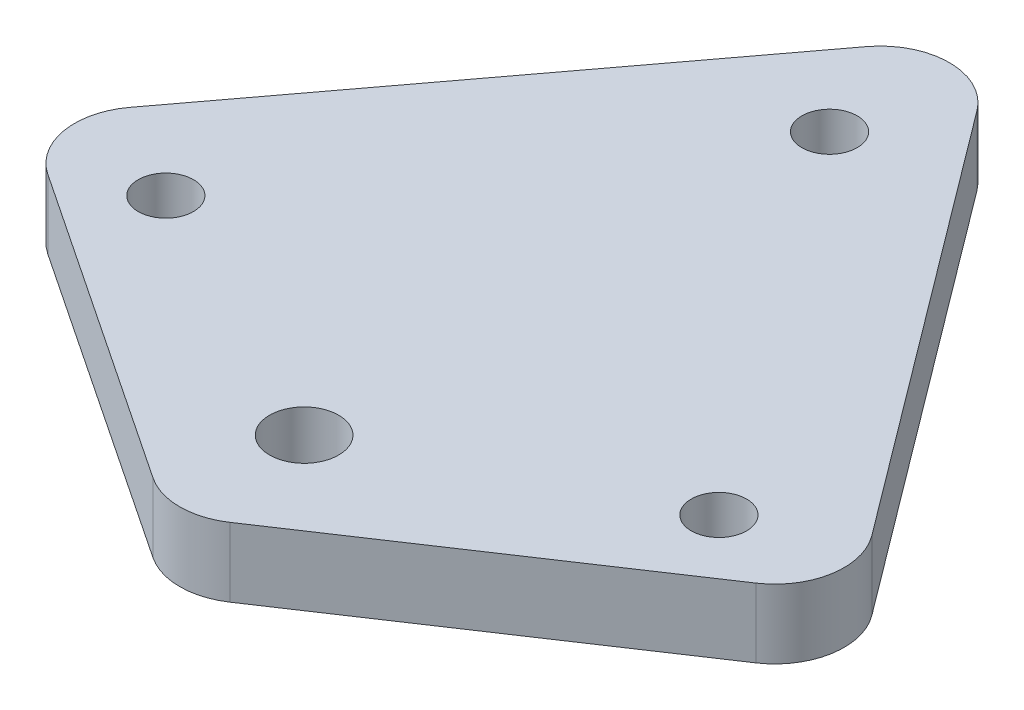
ISO-10303-21;
HEADER;
FILE_DESCRIPTION(('STEP AP214'),'2;1');
FILE_NAME('part.step','',(''),(''),'','','');
FILE_SCHEMA(('AUTOMOTIVE_DESIGN { 1 0 10303 214 1 1 1 1 }'));
ENDSEC;
DATA;
#1=APPLICATION_CONTEXT('core data for automotive mechanical design processes');
#2=APPLICATION_PROTOCOL_DEFINITION('international standard','automotive_design',2000,#1);
#3=PRODUCT_CONTEXT('',#1,'mechanical');
#4=PRODUCT('Part','Part','',(#3));
#5=PRODUCT_RELATED_PRODUCT_CATEGORY('part','',(#4));
#6=PRODUCT_DEFINITION_FORMATION('','',#4);
#7=PRODUCT_DEFINITION_CONTEXT('part definition',#1,'design');
#8=PRODUCT_DEFINITION('design','',#6,#7);
#9=PRODUCT_DEFINITION_SHAPE('','',#8);
#10=(LENGTH_UNIT() NAMED_UNIT(*) SI_UNIT(.MILLI.,.METRE.));
#11=(NAMED_UNIT(*) PLANE_ANGLE_UNIT() SI_UNIT($,.RADIAN.));
#12=(NAMED_UNIT(*) SI_UNIT($,.STERADIAN.) SOLID_ANGLE_UNIT());
#13=UNCERTAINTY_MEASURE_WITH_UNIT(LENGTH_MEASURE(1.E-05),#10,'distance_accuracy_value','');
#14=(GEOMETRIC_REPRESENTATION_CONTEXT(3) GLOBAL_UNCERTAINTY_ASSIGNED_CONTEXT((#13)) GLOBAL_UNIT_ASSIGNED_CONTEXT((#10,
#11,#12)) REPRESENTATION_CONTEXT('',''));
#15=CARTESIAN_POINT('',(0.,0.,0.));
#16=DIRECTION('',(0.,0.,1.));
#17=DIRECTION('',(1.,0.,0.));
#18=AXIS2_PLACEMENT_3D('',#15,#16,#17);
#19=CARTESIAN_POINT('',(0.,6.35,0.));
#20=DIRECTION('',(0.,1.,0.));
#21=DIRECTION('',(0.,0.,1.));
#22=AXIS2_PLACEMENT_3D('',#19,#20,#21);
#23=PLANE('',#22);
#24=CARTESIAN_POINT('',(25.4,6.35,-12.7));
#25=DIRECTION('',(0.,1.,0.));
#26=DIRECTION('',(0.,0.,-1.));
#27=AXIS2_PLACEMENT_3D('',#24,#25,#26);
#28=CIRCLE('',#27,2.54);
#29=CARTESIAN_POINT('',(25.4,6.35,-15.24));
#30=VERTEX_POINT('',#29);
#31=EDGE_CURVE('E201',#30,#30,#28,.T.);
#32=ORIENTED_EDGE('',*,*,#31,.F.);
#33=EDGE_LOOP('',(#32));
#34=FACE_BOUND('',#33,.T.);
#35=CARTESIAN_POINT('',(0.,6.35,0.));
#36=DIRECTION('',(0.,1.,0.));
#37=DIRECTION('',(0.,0.,1.));
#38=AXIS2_PLACEMENT_3D('',#35,#36,#37);
#39=CIRCLE('',#38,3.175);
#40=CARTESIAN_POINT('',(0.,6.35,3.175));
#41=VERTEX_POINT('',#40);
#42=EDGE_CURVE('E213',#41,#41,#39,.T.);
#43=ORIENTED_EDGE('',*,*,#42,.F.);
#44=EDGE_LOOP('',(#43));
#45=FACE_BOUND('',#44,.T.);
#46=DIRECTION('',(-0.6,0.,-0.8));
#47=VECTOR('',#46,1.);
#48=CARTESIAN_POINT('',(0.,6.35,-63.5));
#49=LINE('',#48,#47);
#50=CARTESIAN_POINT('',(34.0724582334673,6.35,-18.0700556887103));
#51=VERTEX_POINT('',#50);
#52=CARTESIAN_POINT('',(5.08,6.35,-56.7266666666667));
#53=VERTEX_POINT('',#52);
#54=EDGE_CURVE('E206',#51,#53,#49,.T.);
#55=ORIENTED_EDGE('',*,*,#54,.T.);
#56=CARTESIAN_POINT('',(0.,6.35,-52.9166666666667));
#57=DIRECTION('',(0.,1.,0.));
#58=DIRECTION('',(0.,0.,1.));
#59=AXIS2_PLACEMENT_3D('',#56,#57,#58);
#60=CIRCLE('',#59,6.35);
#61=CARTESIAN_POINT('',(-5.08,6.35,-56.7266666666667));
#62=VERTEX_POINT('',#61);
#63=EDGE_CURVE('E188',#53,#62,#60,.T.);
#64=ORIENTED_EDGE('',*,*,#63,.T.);
#65=DIRECTION('',(-0.6,0.,0.8));
#66=VECTOR('',#65,1.);
#67=CARTESIAN_POINT('',(0.,6.35,-63.5));
#68=LINE('',#67,#66);
#69=CARTESIAN_POINT('',(-34.0724582334673,6.35,-18.0700556887103));
#70=VERTEX_POINT('',#69);
#71=EDGE_CURVE('E143',#62,#70,#68,.T.);
#72=ORIENTED_EDGE('',*,*,#71,.T.);
#73=CARTESIAN_POINT('',(-28.9924582334673,6.35,-14.2600556887103));
#74=DIRECTION('',(0.,1.,0.));
#75=DIRECTION('',(0.,0.,1.));
#76=AXIS2_PLACEMENT_3D('',#73,#74,#75);
#77=CIRCLE('',#76,6.35);
#78=CARTESIAN_POINT('',(-32.5148044794975,6.35,-8.97653631966499));
#79=VERTEX_POINT('',#78);
#80=EDGE_CURVE('E68',#70,#79,#77,.T.);
#81=ORIENTED_EDGE('',*,*,#80,.T.);
#82=DIRECTION('',(0.832050294337844,0.,0.554700196225229));
#83=VECTOR('',#82,1.);
#84=CARTESIAN_POINT('',(-38.1,6.35,-12.7));
#85=LINE('',#84,#83);
#86=CARTESIAN_POINT('',(-3.5223462460302,6.35,10.3517691693132));
#87=VERTEX_POINT('',#86);
#88=EDGE_CURVE('E167',#79,#87,#85,.T.);
#89=ORIENTED_EDGE('',*,*,#88,.T.);
#90=CARTESIAN_POINT('',(0.,6.35,5.06824980026789));
#91=DIRECTION('',(0.,1.,0.));
#92=DIRECTION('',(0.,0.,1.));
#93=AXIS2_PLACEMENT_3D('',#90,#91,#92);
#94=CIRCLE('',#93,6.35);
#95=CARTESIAN_POINT('',(3.52234624603021,6.35,10.3517691693132));
#96=VERTEX_POINT('',#95);
#97=EDGE_CURVE('E180',#87,#96,#94,.T.);
#98=ORIENTED_EDGE('',*,*,#97,.T.);
#99=DIRECTION('',(0.832050294337844,0.,-0.554700196225229));
#100=VECTOR('',#99,1.);
#101=CARTESIAN_POINT('',(38.1,6.35,-12.7));
#102=LINE('',#101,#100);
#103=CARTESIAN_POINT('',(32.5148044794975,6.35,-8.97653631966499));
#104=VERTEX_POINT('',#103);
#105=EDGE_CURVE('E159',#96,#104,#102,.T.);
#106=ORIENTED_EDGE('',*,*,#105,.T.);
#107=CARTESIAN_POINT('',(28.9924582334673,6.35,-14.2600556887103));
#108=DIRECTION('',(0.,1.,0.));
#109=DIRECTION('',(0.,0.,1.));
#110=AXIS2_PLACEMENT_3D('',#107,#108,#109);
#111=CIRCLE('',#110,6.35);
#112=EDGE_CURVE('E185',#104,#51,#111,.T.);
#113=ORIENTED_EDGE('',*,*,#112,.T.);
#114=EDGE_LOOP('',(#55,#64,#72,#81,#89,#98,#106,#113));
#115=FACE_BOUND('',#114,.T.);
#116=CARTESIAN_POINT('',(-25.4,6.35,-12.7));
#117=DIRECTION('',(0.,1.,0.));
#118=DIRECTION('',(0.,0.,1.));
#119=AXIS2_PLACEMENT_3D('',#116,#117,#118);
#120=CIRCLE('',#119,2.54);
#121=CARTESIAN_POINT('',(-25.4,6.35,-10.16));
#122=VERTEX_POINT('',#121);
#123=EDGE_CURVE('E200',#122,#122,#120,.T.);
#124=ORIENTED_EDGE('',*,*,#123,.F.);
#125=EDGE_LOOP('',(#124));
#126=FACE_BOUND('',#125,.T.);
#127=CARTESIAN_POINT('',(0.,6.35,-48.26));
#128=DIRECTION('',(0.,1.,0.));
#129=DIRECTION('',(0.,0.,1.));
#130=AXIS2_PLACEMENT_3D('',#127,#128,#129);
#131=CIRCLE('',#130,2.54);
#132=CARTESIAN_POINT('',(0.,6.35,-45.72));
#133=VERTEX_POINT('',#132);
#134=EDGE_CURVE('E228',#133,#133,#131,.T.);
#135=ORIENTED_EDGE('',*,*,#134,.F.);
#136=EDGE_LOOP('',(#135));
#137=FACE_BOUND('',#136,.T.);
#138=ADVANCED_FACE('F40',(#34,#45,#115,#126,#137),#23,.T.);
#139=CARTESIAN_POINT('',(0.,0.,0.));
#140=DIRECTION('',(0.,1.,0.));
#141=DIRECTION('',(0.,0.,1.));
#142=AXIS2_PLACEMENT_3D('',#139,#140,#141);
#143=PLANE('',#142);
#144=CARTESIAN_POINT('',(25.4,0.,-12.7));
#145=DIRECTION('',(0.,1.,0.));
#146=DIRECTION('',(0.,0.,-1.));
#147=AXIS2_PLACEMENT_3D('',#144,#145,#146);
#148=CIRCLE('',#147,2.54);
#149=CARTESIAN_POINT('',(25.4,0.,-15.24));
#150=VERTEX_POINT('',#149);
#151=EDGE_CURVE('E220',#150,#150,#148,.T.);
#152=ORIENTED_EDGE('',*,*,#151,.T.);
#153=EDGE_LOOP('',(#152));
#154=FACE_BOUND('',#153,.T.);
#155=CARTESIAN_POINT('',(0.,0.,0.));
#156=DIRECTION('',(0.,1.,0.));
#157=DIRECTION('',(0.,0.,1.));
#158=AXIS2_PLACEMENT_3D('',#155,#156,#157);
#159=CIRCLE('',#158,3.175);
#160=CARTESIAN_POINT('',(0.,0.,3.175));
#161=VERTEX_POINT('',#160);
#162=EDGE_CURVE('E209',#161,#161,#159,.T.);
#163=ORIENTED_EDGE('',*,*,#162,.T.);
#164=EDGE_LOOP('',(#163));
#165=FACE_BOUND('',#164,.T.);
#166=DIRECTION('',(-0.6,0.,0.8));
#167=VECTOR('',#166,1.);
#168=CARTESIAN_POINT('',(0.,0.,-63.5));
#169=LINE('',#168,#167);
#170=CARTESIAN_POINT('',(-5.08,0.,-56.7266666666667));
#171=VERTEX_POINT('',#170);
#172=CARTESIAN_POINT('',(-34.0724582334673,0.,-18.0700556887103));
#173=VERTEX_POINT('',#172);
#174=EDGE_CURVE('E141',#171,#173,#169,.T.);
#175=ORIENTED_EDGE('',*,*,#174,.F.);
#176=CARTESIAN_POINT('',(0.,0.,-52.9166666666667));
#177=DIRECTION('',(0.,1.,0.));
#178=DIRECTION('',(0.,0.,1.));
#179=AXIS2_PLACEMENT_3D('',#176,#177,#178);
#180=CIRCLE('',#179,6.35);
#181=CARTESIAN_POINT('',(5.08,0.,-56.7266666666667));
#182=VERTEX_POINT('',#181);
#183=EDGE_CURVE('E123',#171,#182,#180,.F.);
#184=ORIENTED_EDGE('',*,*,#183,.T.);
#185=DIRECTION('',(-0.6,0.,-0.8));
#186=VECTOR('',#185,1.);
#187=CARTESIAN_POINT('',(0.,0.,-63.5));
#188=LINE('',#187,#186);
#189=CARTESIAN_POINT('',(34.0724582334673,0.,-18.0700556887103));
#190=VERTEX_POINT('',#189);
#191=EDGE_CURVE('E154',#190,#182,#188,.T.);
#192=ORIENTED_EDGE('',*,*,#191,.F.);
#193=CARTESIAN_POINT('',(28.9924582334673,0.,-14.2600556887103));
#194=DIRECTION('',(0.,1.,0.));
#195=DIRECTION('',(0.,0.,1.));
#196=AXIS2_PLACEMENT_3D('',#193,#194,#195);
#197=CIRCLE('',#196,6.35);
#198=CARTESIAN_POINT('',(32.5148044794975,0.,-8.97653631966499));
#199=VERTEX_POINT('',#198);
#200=EDGE_CURVE('E135',#190,#199,#197,.F.);
#201=ORIENTED_EDGE('',*,*,#200,.T.);
#202=DIRECTION('',(0.832050294337844,0.,-0.554700196225229));
#203=VECTOR('',#202,1.);
#204=CARTESIAN_POINT('',(38.1,0.,-12.7));
#205=LINE('',#204,#203);
#206=CARTESIAN_POINT('',(3.52234624603021,0.,10.3517691693132));
#207=VERTEX_POINT('',#206);
#208=EDGE_CURVE('E162',#207,#199,#205,.T.);
#209=ORIENTED_EDGE('',*,*,#208,.F.);
#210=CARTESIAN_POINT('',(0.,0.,5.06824980026789));
#211=DIRECTION('',(0.,1.,0.));
#212=DIRECTION('',(0.,0.,1.));
#213=AXIS2_PLACEMENT_3D('',#210,#211,#212);
#214=CIRCLE('',#213,6.35);
#215=CARTESIAN_POINT('',(-3.5223462460302,0.,10.3517691693132));
#216=VERTEX_POINT('',#215);
#217=EDGE_CURVE('E145',#207,#216,#214,.F.);
#218=ORIENTED_EDGE('',*,*,#217,.T.);
#219=DIRECTION('',(0.832050294337844,0.,0.554700196225229));
#220=VECTOR('',#219,1.);
#221=CARTESIAN_POINT('',(-38.1,0.,-12.7));
#222=LINE('',#221,#220);
#223=CARTESIAN_POINT('',(-32.5148044794975,0.,-8.97653631966499));
#224=VERTEX_POINT('',#223);
#225=EDGE_CURVE('E153',#224,#216,#222,.T.);
#226=ORIENTED_EDGE('',*,*,#225,.F.);
#227=CARTESIAN_POINT('',(-28.9924582334673,0.,-14.2600556887103));
#228=DIRECTION('',(0.,1.,0.));
#229=DIRECTION('',(0.,0.,1.));
#230=AXIS2_PLACEMENT_3D('',#227,#228,#229);
#231=CIRCLE('',#230,6.35);
#232=EDGE_CURVE('E151',#224,#173,#231,.F.);
#233=ORIENTED_EDGE('',*,*,#232,.T.);
#234=EDGE_LOOP('',(#175,#184,#192,#201,#209,#218,#226,#233));
#235=FACE_BOUND('',#234,.T.);
#236=CARTESIAN_POINT('',(-25.4,0.,-12.7));
#237=DIRECTION('',(0.,1.,0.));
#238=DIRECTION('',(0.,0.,1.));
#239=AXIS2_PLACEMENT_3D('',#236,#237,#238);
#240=CIRCLE('',#239,2.54);
#241=CARTESIAN_POINT('',(-25.4,0.,-10.16));
#242=VERTEX_POINT('',#241);
#243=EDGE_CURVE('E197',#242,#242,#240,.T.);
#244=ORIENTED_EDGE('',*,*,#243,.T.);
#245=EDGE_LOOP('',(#244));
#246=FACE_BOUND('',#245,.T.);
#247=CARTESIAN_POINT('',(0.,0.,-48.26));
#248=DIRECTION('',(0.,1.,0.));
#249=DIRECTION('',(0.,0.,1.));
#250=AXIS2_PLACEMENT_3D('',#247,#248,#249);
#251=CIRCLE('',#250,2.54);
#252=CARTESIAN_POINT('',(0.,0.,-45.72));
#253=VERTEX_POINT('',#252);
#254=EDGE_CURVE('E231',#253,#253,#251,.T.);
#255=ORIENTED_EDGE('',*,*,#254,.T.);
#256=EDGE_LOOP('',(#255));
#257=FACE_BOUND('',#256,.T.);
#258=ADVANCED_FACE('F148',(#154,#165,#235,#246,#257),#143,.F.);
#259=CARTESIAN_POINT('',(38.1,6.35,-12.7));
#260=DIRECTION('',(-0.554700196225229,0.,-0.832050294337844));
#261=DIRECTION('',(-0.832050294337844,0.,0.554700196225229));
#262=AXIS2_PLACEMENT_3D('',#259,#260,#261);
#263=PLANE('',#262);
#264=ORIENTED_EDGE('',*,*,#208,.T.);
#265=DIRECTION('',(0.,-1.,0.));
#266=VECTOR('',#265,1.);
#267=CARTESIAN_POINT('',(32.5148044794975,6.35,-8.97653631966499));
#268=LINE('',#267,#266);
#269=EDGE_CURVE('E194',#199,#104,#268,.F.);
#270=ORIENTED_EDGE('',*,*,#269,.T.);
#271=ORIENTED_EDGE('',*,*,#105,.F.);
#272=DIRECTION('',(0.,-1.,0.));
#273=VECTOR('',#272,1.);
#274=CARTESIAN_POINT('',(3.52234624603021,6.35,10.3517691693132));
#275=LINE('',#274,#273);
#276=EDGE_CURVE('E191',#96,#207,#275,.T.);
#277=ORIENTED_EDGE('',*,*,#276,.T.);
#278=EDGE_LOOP('',(#264,#270,#271,#277));
#279=FACE_BOUND('',#278,.T.);
#280=ADVANCED_FACE('F265',(#279),#263,.F.);
#281=CARTESIAN_POINT('',(0.,6.35,-63.5));
#282=DIRECTION('',(-0.8,0.,0.6));
#283=DIRECTION('',(0.6,0.,0.8));
#284=AXIS2_PLACEMENT_3D('',#281,#282,#283);
#285=PLANE('',#284);
#286=ORIENTED_EDGE('',*,*,#191,.T.);
#287=DIRECTION('',(0.,-1.,0.));
#288=VECTOR('',#287,1.);
#289=CARTESIAN_POINT('',(5.08,6.35,-56.7266666666667));
#290=LINE('',#289,#288);
#291=EDGE_CURVE('E128',#182,#53,#290,.F.);
#292=ORIENTED_EDGE('',*,*,#291,.T.);
#293=ORIENTED_EDGE('',*,*,#54,.F.);
#294=DIRECTION('',(0.,-1.,0.));
#295=VECTOR('',#294,1.);
#296=CARTESIAN_POINT('',(34.0724582334673,6.35,-18.0700556887103));
#297=LINE('',#296,#295);
#298=EDGE_CURVE('E134',#51,#190,#297,.T.);
#299=ORIENTED_EDGE('',*,*,#298,.T.);
#300=EDGE_LOOP('',(#286,#292,#293,#299));
#301=FACE_BOUND('',#300,.T.);
#302=ADVANCED_FACE('F279',(#301),#285,.F.);
#303=CARTESIAN_POINT('',(0.,6.35,-63.5));
#304=DIRECTION('',(0.8,0.,0.6));
#305=DIRECTION('',(0.6,0.,-0.8));
#306=AXIS2_PLACEMENT_3D('',#303,#304,#305);
#307=PLANE('',#306);
#308=ORIENTED_EDGE('',*,*,#71,.F.);
#309=DIRECTION('',(0.,-1.,0.));
#310=VECTOR('',#309,1.);
#311=CARTESIAN_POINT('',(-5.08,6.35,-56.7266666666667));
#312=LINE('',#311,#310);
#313=EDGE_CURVE('E127',#62,#171,#312,.T.);
#314=ORIENTED_EDGE('',*,*,#313,.T.);
#315=ORIENTED_EDGE('',*,*,#174,.T.);
#316=DIRECTION('',(0.,-1.,0.));
#317=VECTOR('',#316,1.);
#318=CARTESIAN_POINT('',(-34.0724582334673,6.35,-18.0700556887103));
#319=LINE('',#318,#317);
#320=EDGE_CURVE('E146',#173,#70,#319,.F.);
#321=ORIENTED_EDGE('',*,*,#320,.T.);
#322=EDGE_LOOP('',(#308,#314,#315,#321));
#323=FACE_BOUND('',#322,.T.);
#324=ADVANCED_FACE('F140',(#323),#307,.F.);
#325=CARTESIAN_POINT('',(-38.1,6.35,-12.7));
#326=DIRECTION('',(0.554700196225229,0.,-0.832050294337844));
#327=DIRECTION('',(-0.832050294337844,0.,-0.554700196225229));
#328=AXIS2_PLACEMENT_3D('',#325,#326,#327);
#329=PLANE('',#328);
#330=ORIENTED_EDGE('',*,*,#88,.F.);
#331=DIRECTION('',(0.,-1.,0.));
#332=VECTOR('',#331,1.);
#333=CARTESIAN_POINT('',(-32.5148044794975,6.35,-8.97653631966499));
#334=LINE('',#333,#332);
#335=EDGE_CURVE('E11',#79,#224,#334,.T.);
#336=ORIENTED_EDGE('',*,*,#335,.T.);
#337=ORIENTED_EDGE('',*,*,#225,.T.);
#338=DIRECTION('',(0.,-1.,0.));
#339=VECTOR('',#338,1.);
#340=CARTESIAN_POINT('',(-3.5223462460302,6.35,10.3517691693132));
#341=LINE('',#340,#339);
#342=EDGE_CURVE('E49',#216,#87,#341,.F.);
#343=ORIENTED_EDGE('',*,*,#342,.T.);
#344=EDGE_LOOP('',(#330,#336,#337,#343));
#345=FACE_BOUND('',#344,.T.);
#346=ADVANCED_FACE('F274',(#345),#329,.F.);
#347=CARTESIAN_POINT('',(0.,6.35,0.));
#348=DIRECTION('',(0.,-1.,0.));
#349=DIRECTION('',(0.,0.,-1.));
#350=AXIS2_PLACEMENT_3D('',#347,#348,#349);
#351=CYLINDRICAL_SURFACE('',#350,3.175);
#352=ORIENTED_EDGE('',*,*,#42,.T.);
#353=EDGE_LOOP('',(#352));
#354=FACE_BOUND('',#353,.T.);
#355=ORIENTED_EDGE('',*,*,#162,.F.);
#356=EDGE_LOOP('',(#355));
#357=FACE_BOUND('',#356,.T.);
#358=ADVANCED_FACE('F271',(#354,#357),#351,.F.);
#359=CARTESIAN_POINT('',(-25.4,6.35,-12.7));
#360=DIRECTION('',(0.,-1.,0.));
#361=DIRECTION('',(0.,0.,-1.));
#362=AXIS2_PLACEMENT_3D('',#359,#360,#361);
#363=CYLINDRICAL_SURFACE('',#362,2.54);
#364=ORIENTED_EDGE('',*,*,#123,.T.);
#365=EDGE_LOOP('',(#364));
#366=FACE_BOUND('',#365,.T.);
#367=ORIENTED_EDGE('',*,*,#243,.F.);
#368=EDGE_LOOP('',(#367));
#369=FACE_BOUND('',#368,.T.);
#370=ADVANCED_FACE('F257',(#366,#369),#363,.F.);
#371=CARTESIAN_POINT('',(25.4,6.35,-12.7));
#372=DIRECTION('',(0.,-1.,0.));
#373=DIRECTION('',(0.,0.,-1.));
#374=AXIS2_PLACEMENT_3D('',#371,#372,#373);
#375=CYLINDRICAL_SURFACE('',#374,2.54);
#376=ORIENTED_EDGE('',*,*,#31,.T.);
#377=EDGE_LOOP('',(#376));
#378=FACE_BOUND('',#377,.T.);
#379=ORIENTED_EDGE('',*,*,#151,.F.);
#380=EDGE_LOOP('',(#379));
#381=FACE_BOUND('',#380,.T.);
#382=ADVANCED_FACE('F248',(#378,#381),#375,.F.);
#383=CARTESIAN_POINT('',(0.,6.35,-48.26));
#384=DIRECTION('',(0.,-1.,0.));
#385=DIRECTION('',(0.,0.,-1.));
#386=AXIS2_PLACEMENT_3D('',#383,#384,#385);
#387=CYLINDRICAL_SURFACE('',#386,2.54);
#388=ORIENTED_EDGE('',*,*,#134,.T.);
#389=EDGE_LOOP('',(#388));
#390=FACE_BOUND('',#389,.T.);
#391=ORIENTED_EDGE('',*,*,#254,.F.);
#392=EDGE_LOOP('',(#391));
#393=FACE_BOUND('',#392,.T.);
#394=ADVANCED_FACE('F246',(#390,#393),#387,.F.);
#395=CARTESIAN_POINT('',(0.,6.35,-52.9166666666667));
#396=DIRECTION('',(0.,-1.,0.));
#397=DIRECTION('',(0.,0.,-1.));
#398=AXIS2_PLACEMENT_3D('',#395,#396,#397);
#399=CYLINDRICAL_SURFACE('',#398,6.35);
#400=ORIENTED_EDGE('',*,*,#63,.F.);
#401=ORIENTED_EDGE('',*,*,#291,.F.);
#402=ORIENTED_EDGE('',*,*,#183,.F.);
#403=ORIENTED_EDGE('',*,*,#313,.F.);
#404=EDGE_LOOP('',(#400,#401,#402,#403));
#405=FACE_BOUND('',#404,.T.);
#406=ADVANCED_FACE('F126',(#405),#399,.T.);
#407=CARTESIAN_POINT('',(28.9924582334673,6.35,-14.2600556887103));
#408=DIRECTION('',(0.,-1.,0.));
#409=DIRECTION('',(0.,0.,-1.));
#410=AXIS2_PLACEMENT_3D('',#407,#408,#409);
#411=CYLINDRICAL_SURFACE('',#410,6.35);
#412=ORIENTED_EDGE('',*,*,#112,.F.);
#413=ORIENTED_EDGE('',*,*,#269,.F.);
#414=ORIENTED_EDGE('',*,*,#200,.F.);
#415=ORIENTED_EDGE('',*,*,#298,.F.);
#416=EDGE_LOOP('',(#412,#413,#414,#415));
#417=FACE_BOUND('',#416,.T.);
#418=ADVANCED_FACE('F255',(#417),#411,.T.);
#419=CARTESIAN_POINT('',(-28.9924582334673,6.35,-14.2600556887103));
#420=DIRECTION('',(0.,-1.,0.));
#421=DIRECTION('',(0.,0.,-1.));
#422=AXIS2_PLACEMENT_3D('',#419,#420,#421);
#423=CYLINDRICAL_SURFACE('',#422,6.35);
#424=ORIENTED_EDGE('',*,*,#80,.F.);
#425=ORIENTED_EDGE('',*,*,#320,.F.);
#426=ORIENTED_EDGE('',*,*,#232,.F.);
#427=ORIENTED_EDGE('',*,*,#335,.F.);
#428=EDGE_LOOP('',(#424,#425,#426,#427));
#429=FACE_BOUND('',#428,.T.);
#430=ADVANCED_FACE('F287',(#429),#423,.T.);
#431=CARTESIAN_POINT('',(0.,6.35,5.06824980026789));
#432=DIRECTION('',(0.,-1.,0.));
#433=DIRECTION('',(0.,0.,-1.));
#434=AXIS2_PLACEMENT_3D('',#431,#432,#433);
#435=CYLINDRICAL_SURFACE('',#434,6.35);
#436=ORIENTED_EDGE('',*,*,#97,.F.);
#437=ORIENTED_EDGE('',*,*,#342,.F.);
#438=ORIENTED_EDGE('',*,*,#217,.F.);
#439=ORIENTED_EDGE('',*,*,#276,.F.);
#440=EDGE_LOOP('',(#436,#437,#438,#439));
#441=FACE_BOUND('',#440,.T.);
#442=ADVANCED_FACE('F42',(#441),#435,.T.);
#443=CLOSED_SHELL('',(#138,#258,#280,#302,#324,#346,#358,#370,#382,#394,#406,#418,#430,#442));
#444=MANIFOLD_SOLID_BREP('B2',#443);
#445=ADVANCED_BREP_SHAPE_REPRESENTATION('',(#18,#444),#14);
#446=SHAPE_DEFINITION_REPRESENTATION(#9,#445);
ENDSEC;
END-ISO-10303-21;
